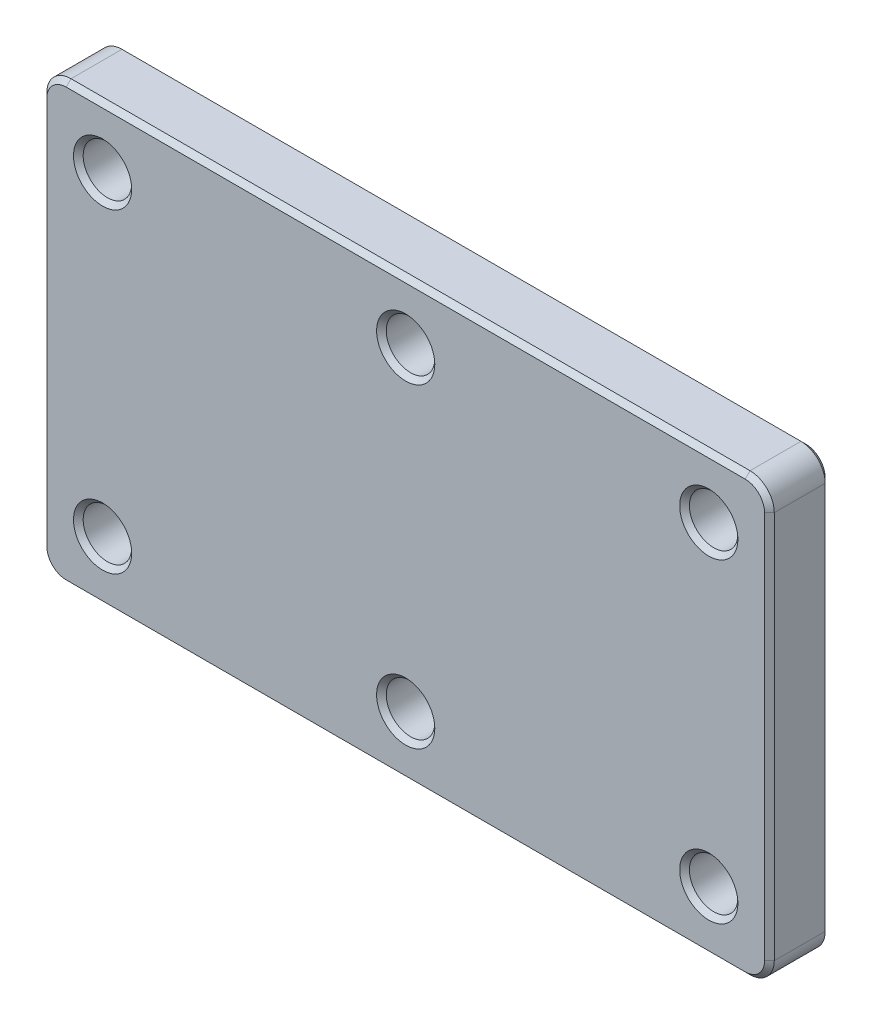
ISO-10303-21;
HEADER;
FILE_DESCRIPTION(('STEP AP214'),'2;1');
FILE_NAME('part.step','',(''),(''),'','','');
FILE_SCHEMA(('AUTOMOTIVE_DESIGN { 1 0 10303 214 1 1 1 1 }'));
ENDSEC;
DATA;
#1=APPLICATION_CONTEXT('core data for automotive mechanical design processes');
#2=APPLICATION_PROTOCOL_DEFINITION('international standard','automotive_design',2000,#1);
#3=PRODUCT_CONTEXT('',#1,'mechanical');
#4=PRODUCT('Part','Part','',(#3));
#5=PRODUCT_RELATED_PRODUCT_CATEGORY('part','',(#4));
#6=PRODUCT_DEFINITION_FORMATION('','',#4);
#7=PRODUCT_DEFINITION_CONTEXT('part definition',#1,'design');
#8=PRODUCT_DEFINITION('design','',#6,#7);
#9=PRODUCT_DEFINITION_SHAPE('','',#8);
#10=(LENGTH_UNIT() NAMED_UNIT(*) SI_UNIT(.MILLI.,.METRE.));
#11=(NAMED_UNIT(*) PLANE_ANGLE_UNIT() SI_UNIT($,.RADIAN.));
#12=(NAMED_UNIT(*) SI_UNIT($,.STERADIAN.) SOLID_ANGLE_UNIT());
#13=UNCERTAINTY_MEASURE_WITH_UNIT(LENGTH_MEASURE(1.E-05),#10,'distance_accuracy_value','');
#14=(GEOMETRIC_REPRESENTATION_CONTEXT(3) GLOBAL_UNCERTAINTY_ASSIGNED_CONTEXT((#13)) GLOBAL_UNIT_ASSIGNED_CONTEXT((#10,
#11,#12)) REPRESENTATION_CONTEXT('',''));
#15=CARTESIAN_POINT('',(0.,0.,0.));
#16=DIRECTION('',(0.,0.,1.));
#17=DIRECTION('',(1.,0.,0.));
#18=AXIS2_PLACEMENT_3D('',#15,#16,#17);
#19=CARTESIAN_POINT('',(-140.,-80.,-25.));
#20=DIRECTION('',(0.,0.,1.));
#21=DIRECTION('',(1.,0.,0.));
#22=AXIS2_PLACEMENT_3D('',#19,#20,#21);
#23=CYLINDRICAL_SURFACE('',#22,10.);
#24=DIRECTION('',(0.,0.,1.));
#25=VECTOR('',#24,1.);
#26=CARTESIAN_POINT('',(-150.,-79.9999999999999,-25.));
#27=LINE('',#26,#25);
#28=CARTESIAN_POINT('',(-150.,-79.9999999999999,-22.9999999999999));
#29=VERTEX_POINT('',#28);
#30=CARTESIAN_POINT('',(-150.,-79.9999999999999,-2.));
#31=VERTEX_POINT('',#30);
#32=EDGE_CURVE('E171',#29,#31,#27,.T.);
#33=ORIENTED_EDGE('',*,*,#32,.F.);
#34=CARTESIAN_POINT('',(-140.,-80.,-22.9999999999999));
#35=DIRECTION('',(0.,0.,1.));
#36=DIRECTION('',(1.,0.,0.));
#37=AXIS2_PLACEMENT_3D('',#34,#35,#36);
#38=CIRCLE('',#37,10.);
#39=CARTESIAN_POINT('',(-140.,-90.,-22.9999999999999));
#40=VERTEX_POINT('',#39);
#41=EDGE_CURVE('E256',#29,#40,#38,.T.);
#42=ORIENTED_EDGE('',*,*,#41,.T.);
#43=DIRECTION('',(0.,0.,1.));
#44=VECTOR('',#43,1.);
#45=CARTESIAN_POINT('',(-140.,-90.,-25.));
#46=LINE('',#45,#44);
#47=CARTESIAN_POINT('',(-140.,-90.,-2.));
#48=VERTEX_POINT('',#47);
#49=EDGE_CURVE('E177',#40,#48,#46,.T.);
#50=ORIENTED_EDGE('',*,*,#49,.T.);
#51=CARTESIAN_POINT('',(-140.,-80.,-2.));
#52=DIRECTION('',(0.,0.,1.));
#53=DIRECTION('',(1.,0.,0.));
#54=AXIS2_PLACEMENT_3D('',#51,#52,#53);
#55=CIRCLE('',#54,10.);
#56=EDGE_CURVE('E254',#48,#31,#55,.F.);
#57=ORIENTED_EDGE('',*,*,#56,.T.);
#58=EDGE_LOOP('',(#33,#42,#50,#57));
#59=FACE_BOUND('',#58,.T.);
#60=ADVANCED_FACE('F33',(#59),#23,.T.);
#61=CARTESIAN_POINT('',(-150.,-79.9999999999999,-25.));
#62=DIRECTION('',(-1.,0.,0.));
#63=DIRECTION('',(0.,0.,1.));
#64=AXIS2_PLACEMENT_3D('',#61,#62,#63);
#65=PLANE('',#64);
#66=DIRECTION('',(0.,0.,1.));
#67=VECTOR('',#66,1.);
#68=CARTESIAN_POINT('',(-150.,79.9999999999999,-25.));
#69=LINE('',#68,#67);
#70=CARTESIAN_POINT('',(-150.,79.9999999999999,-22.9999999999999));
#71=VERTEX_POINT('',#70);
#72=CARTESIAN_POINT('',(-150.,79.9999999999999,-2.));
#73=VERTEX_POINT('',#72);
#74=EDGE_CURVE('E174',#71,#73,#69,.T.);
#75=ORIENTED_EDGE('',*,*,#74,.F.);
#76=DIRECTION('',(0.,-1.,0.));
#77=VECTOR('',#76,1.);
#78=CARTESIAN_POINT('',(-150.,-79.9999999999999,-22.9999999999999));
#79=LINE('',#78,#77);
#80=EDGE_CURVE('E260',#71,#29,#79,.T.);
#81=ORIENTED_EDGE('',*,*,#80,.T.);
#82=ORIENTED_EDGE('',*,*,#32,.T.);
#83=DIRECTION('',(0.,1.,0.));
#84=VECTOR('',#83,1.);
#85=CARTESIAN_POINT('',(-150.,-79.9999999999999,-2.));
#86=LINE('',#85,#84);
#87=EDGE_CURVE('E258',#31,#73,#86,.T.);
#88=ORIENTED_EDGE('',*,*,#87,.T.);
#89=EDGE_LOOP('',(#75,#81,#82,#88));
#90=FACE_BOUND('',#89,.T.);
#91=ADVANCED_FACE('F362',(#90),#65,.T.);
#92=CARTESIAN_POINT('',(-140.,80.,-25.));
#93=DIRECTION('',(0.,0.,1.));
#94=DIRECTION('',(1.,0.,0.));
#95=AXIS2_PLACEMENT_3D('',#92,#93,#94);
#96=CYLINDRICAL_SURFACE('',#95,10.);
#97=DIRECTION('',(0.,0.,1.));
#98=VECTOR('',#97,1.);
#99=CARTESIAN_POINT('',(-140.,90.,-25.));
#100=LINE('',#99,#98);
#101=CARTESIAN_POINT('',(-140.,90.,-22.9999999999999));
#102=VERTEX_POINT('',#101);
#103=CARTESIAN_POINT('',(-140.,90.,-2.));
#104=VERTEX_POINT('',#103);
#105=EDGE_CURVE('E390',#102,#104,#100,.T.);
#106=ORIENTED_EDGE('',*,*,#105,.F.);
#107=CARTESIAN_POINT('',(-140.,80.,-22.9999999999999));
#108=DIRECTION('',(0.,0.,1.));
#109=DIRECTION('',(1.,0.,0.));
#110=AXIS2_PLACEMENT_3D('',#107,#108,#109);
#111=CIRCLE('',#110,10.);
#112=EDGE_CURVE('E264',#102,#71,#111,.T.);
#113=ORIENTED_EDGE('',*,*,#112,.T.);
#114=ORIENTED_EDGE('',*,*,#74,.T.);
#115=CARTESIAN_POINT('',(-140.,80.,-2.));
#116=DIRECTION('',(0.,0.,1.));
#117=DIRECTION('',(1.,0.,0.));
#118=AXIS2_PLACEMENT_3D('',#115,#116,#117);
#119=CIRCLE('',#118,10.);
#120=EDGE_CURVE('E262',#73,#104,#119,.F.);
#121=ORIENTED_EDGE('',*,*,#120,.T.);
#122=EDGE_LOOP('',(#106,#113,#114,#121));
#123=FACE_BOUND('',#122,.T.);
#124=ADVANCED_FACE('F396',(#123),#96,.T.);
#125=CARTESIAN_POINT('',(-140.,90.,-25.));
#126=DIRECTION('',(0.,1.,0.));
#127=DIRECTION('',(-1.,0.,0.));
#128=AXIS2_PLACEMENT_3D('',#125,#126,#127);
#129=PLANE('',#128);
#130=DIRECTION('',(0.,0.,1.));
#131=VECTOR('',#130,1.);
#132=CARTESIAN_POINT('',(140.,90.0000000000001,-25.));
#133=LINE('',#132,#131);
#134=CARTESIAN_POINT('',(140.,90.0000000000001,-22.9999999999999));
#135=VERTEX_POINT('',#134);
#136=CARTESIAN_POINT('',(140.,90.0000000000001,-2.));
#137=VERTEX_POINT('',#136);
#138=EDGE_CURVE('E387',#135,#137,#133,.T.);
#139=ORIENTED_EDGE('',*,*,#138,.F.);
#140=DIRECTION('',(-1.,0.,0.));
#141=VECTOR('',#140,1.);
#142=CARTESIAN_POINT('',(-140.,90.,-22.9999999999999));
#143=LINE('',#142,#141);
#144=EDGE_CURVE('E268',#135,#102,#143,.T.);
#145=ORIENTED_EDGE('',*,*,#144,.T.);
#146=ORIENTED_EDGE('',*,*,#105,.T.);
#147=DIRECTION('',(1.,0.,0.));
#148=VECTOR('',#147,1.);
#149=CARTESIAN_POINT('',(-140.,90.,-2.));
#150=LINE('',#149,#148);
#151=EDGE_CURVE('E266',#104,#137,#150,.T.);
#152=ORIENTED_EDGE('',*,*,#151,.T.);
#153=EDGE_LOOP('',(#139,#145,#146,#152));
#154=FACE_BOUND('',#153,.T.);
#155=ADVANCED_FACE('F411',(#154),#129,.T.);
#156=CARTESIAN_POINT('',(140.,80.,-25.));
#157=DIRECTION('',(0.,0.,1.));
#158=DIRECTION('',(1.,0.,0.));
#159=AXIS2_PLACEMENT_3D('',#156,#157,#158);
#160=CYLINDRICAL_SURFACE('',#159,10.);
#161=DIRECTION('',(0.,0.,1.));
#162=VECTOR('',#161,1.);
#163=CARTESIAN_POINT('',(150.,80.,-25.));
#164=LINE('',#163,#162);
#165=CARTESIAN_POINT('',(150.,80.,-22.9999999999999));
#166=VERTEX_POINT('',#165);
#167=CARTESIAN_POINT('',(150.,80.,-2.));
#168=VERTEX_POINT('',#167);
#169=EDGE_CURVE('E382',#166,#168,#164,.T.);
#170=ORIENTED_EDGE('',*,*,#169,.F.);
#171=CARTESIAN_POINT('',(140.,80.,-22.9999999999999));
#172=DIRECTION('',(0.,0.,1.));
#173=DIRECTION('',(1.,0.,0.));
#174=AXIS2_PLACEMENT_3D('',#171,#172,#173);
#175=CIRCLE('',#174,10.);
#176=EDGE_CURVE('E162',#166,#135,#175,.T.);
#177=ORIENTED_EDGE('',*,*,#176,.T.);
#178=ORIENTED_EDGE('',*,*,#138,.T.);
#179=CARTESIAN_POINT('',(140.,80.,-2.));
#180=DIRECTION('',(0.,0.,1.));
#181=DIRECTION('',(1.,0.,0.));
#182=AXIS2_PLACEMENT_3D('',#179,#180,#181);
#183=CIRCLE('',#182,10.);
#184=EDGE_CURVE('E270',#137,#168,#183,.F.);
#185=ORIENTED_EDGE('',*,*,#184,.T.);
#186=EDGE_LOOP('',(#170,#177,#178,#185));
#187=FACE_BOUND('',#186,.T.);
#188=ADVANCED_FACE('F416',(#187),#160,.T.);
#189=CARTESIAN_POINT('',(150.,80.,-25.));
#190=DIRECTION('',(1.,0.,0.));
#191=DIRECTION('',(0.,1.,0.));
#192=AXIS2_PLACEMENT_3D('',#189,#190,#191);
#193=PLANE('',#192);
#194=DIRECTION('',(0.,0.,1.));
#195=VECTOR('',#194,1.);
#196=CARTESIAN_POINT('',(150.,-79.9999999999999,-25.));
#197=LINE('',#196,#195);
#198=CARTESIAN_POINT('',(150.,-79.9999999999999,-22.9999999999999));
#199=VERTEX_POINT('',#198);
#200=CARTESIAN_POINT('',(150.,-79.9999999999999,-2.));
#201=VERTEX_POINT('',#200);
#202=EDGE_CURVE('E380',#199,#201,#197,.T.);
#203=ORIENTED_EDGE('',*,*,#202,.F.);
#204=DIRECTION('',(0.,1.,0.));
#205=VECTOR('',#204,1.);
#206=CARTESIAN_POINT('',(150.,80.,-22.9999999999999));
#207=LINE('',#206,#205);
#208=EDGE_CURVE('E276',#199,#166,#207,.T.);
#209=ORIENTED_EDGE('',*,*,#208,.T.);
#210=ORIENTED_EDGE('',*,*,#169,.T.);
#211=DIRECTION('',(0.,-1.,0.));
#212=VECTOR('',#211,1.);
#213=CARTESIAN_POINT('',(150.,80.,-2.));
#214=LINE('',#213,#212);
#215=EDGE_CURVE('E274',#168,#201,#214,.T.);
#216=ORIENTED_EDGE('',*,*,#215,.T.);
#217=EDGE_LOOP('',(#203,#209,#210,#216));
#218=FACE_BOUND('',#217,.T.);
#219=ADVANCED_FACE('F425',(#218),#193,.T.);
#220=CARTESIAN_POINT('',(140.,-80.,-25.));
#221=DIRECTION('',(0.,0.,1.));
#222=DIRECTION('',(1.,0.,0.));
#223=AXIS2_PLACEMENT_3D('',#220,#221,#222);
#224=CYLINDRICAL_SURFACE('',#223,10.);
#225=DIRECTION('',(0.,0.,1.));
#226=VECTOR('',#225,1.);
#227=CARTESIAN_POINT('',(140.,-90.,-25.));
#228=LINE('',#227,#226);
#229=CARTESIAN_POINT('',(140.,-90.,-22.9999999999999));
#230=VERTEX_POINT('',#229);
#231=CARTESIAN_POINT('',(140.,-90.,-2.));
#232=VERTEX_POINT('',#231);
#233=EDGE_CURVE('E379',#230,#232,#228,.T.);
#234=ORIENTED_EDGE('',*,*,#233,.F.);
#235=CARTESIAN_POINT('',(140.,-80.,-22.9999999999999));
#236=DIRECTION('',(0.,0.,1.));
#237=DIRECTION('',(1.,0.,0.));
#238=AXIS2_PLACEMENT_3D('',#235,#236,#237);
#239=CIRCLE('',#238,10.);
#240=EDGE_CURVE('E247',#230,#199,#239,.T.);
#241=ORIENTED_EDGE('',*,*,#240,.T.);
#242=ORIENTED_EDGE('',*,*,#202,.T.);
#243=CARTESIAN_POINT('',(140.,-80.,-2.));
#244=DIRECTION('',(0.,0.,1.));
#245=DIRECTION('',(1.,0.,0.));
#246=AXIS2_PLACEMENT_3D('',#243,#244,#245);
#247=CIRCLE('',#246,10.);
#248=EDGE_CURVE('E245',#201,#232,#247,.F.);
#249=ORIENTED_EDGE('',*,*,#248,.T.);
#250=EDGE_LOOP('',(#234,#241,#242,#249));
#251=FACE_BOUND('',#250,.T.);
#252=ADVANCED_FACE('F428',(#251),#224,.T.);
#253=CARTESIAN_POINT('',(140.,-90.,-25.));
#254=DIRECTION('',(0.,-1.,0.));
#255=DIRECTION('',(1.,0.,0.));
#256=AXIS2_PLACEMENT_3D('',#253,#254,#255);
#257=PLANE('',#256);
#258=ORIENTED_EDGE('',*,*,#49,.F.);
#259=DIRECTION('',(1.,0.,0.));
#260=VECTOR('',#259,1.);
#261=CARTESIAN_POINT('',(140.,-90.,-22.9999999999999));
#262=LINE('',#261,#260);
#263=EDGE_CURVE('E252',#40,#230,#262,.T.);
#264=ORIENTED_EDGE('',*,*,#263,.T.);
#265=ORIENTED_EDGE('',*,*,#233,.T.);
#266=DIRECTION('',(-1.,0.,0.));
#267=VECTOR('',#266,1.);
#268=CARTESIAN_POINT('',(140.,-90.,-2.));
#269=LINE('',#268,#267);
#270=EDGE_CURVE('E250',#232,#48,#269,.T.);
#271=ORIENTED_EDGE('',*,*,#270,.T.);
#272=EDGE_LOOP('',(#258,#264,#265,#271));
#273=FACE_BOUND('',#272,.T.);
#274=ADVANCED_FACE('F376',(#273),#257,.T.);
#275=CARTESIAN_POINT('',(-140.,-80.,-25.));
#276=DIRECTION('',(0.,0.,1.));
#277=DIRECTION('',(1.,0.,0.));
#278=AXIS2_PLACEMENT_3D('',#275,#276,#277);
#279=PLANE('',#278);
#280=CARTESIAN_POINT('',(-125.,65.,-25.));
#281=DIRECTION('',(0.,0.,1.));
#282=DIRECTION('',(1.,0.,0.));
#283=AXIS2_PLACEMENT_3D('',#280,#281,#282);
#284=CIRCLE('',#283,12.);
#285=CARTESIAN_POINT('',(-113.,65.,-25.));
#286=VERTEX_POINT('',#285);
#287=EDGE_CURVE('E206',#286,#286,#284,.T.);
#288=ORIENTED_EDGE('',*,*,#287,.T.);
#289=EDGE_LOOP('',(#288));
#290=FACE_BOUND('',#289,.T.);
#291=CARTESIAN_POINT('',(0.,65.,-25.));
#292=DIRECTION('',(0.,0.,1.));
#293=DIRECTION('',(1.,0.,0.));
#294=AXIS2_PLACEMENT_3D('',#291,#292,#293);
#295=CIRCLE('',#294,12.0000000000001);
#296=CARTESIAN_POINT('',(12.0000000000001,65.,-25.));
#297=VERTEX_POINT('',#296);
#298=EDGE_CURVE('E203',#297,#297,#295,.T.);
#299=ORIENTED_EDGE('',*,*,#298,.T.);
#300=EDGE_LOOP('',(#299));
#301=FACE_BOUND('',#300,.T.);
#302=CARTESIAN_POINT('',(125.,65.,-25.));
#303=DIRECTION('',(0.,0.,1.));
#304=DIRECTION('',(1.,0.,0.));
#305=AXIS2_PLACEMENT_3D('',#302,#303,#304);
#306=CIRCLE('',#305,12.);
#307=CARTESIAN_POINT('',(137.,65.,-25.));
#308=VERTEX_POINT('',#307);
#309=EDGE_CURVE('E200',#308,#308,#306,.T.);
#310=ORIENTED_EDGE('',*,*,#309,.T.);
#311=EDGE_LOOP('',(#310));
#312=FACE_BOUND('',#311,.T.);
#313=CARTESIAN_POINT('',(125.,-65.,-25.));
#314=DIRECTION('',(0.,0.,1.));
#315=DIRECTION('',(1.,0.,0.));
#316=AXIS2_PLACEMENT_3D('',#313,#314,#315);
#317=CIRCLE('',#316,12.);
#318=CARTESIAN_POINT('',(137.,-65.,-25.));
#319=VERTEX_POINT('',#318);
#320=EDGE_CURVE('E197',#319,#319,#317,.T.);
#321=ORIENTED_EDGE('',*,*,#320,.T.);
#322=EDGE_LOOP('',(#321));
#323=FACE_BOUND('',#322,.T.);
#324=CARTESIAN_POINT('',(0.,-65.,-25.));
#325=DIRECTION('',(0.,0.,1.));
#326=DIRECTION('',(1.,0.,0.));
#327=AXIS2_PLACEMENT_3D('',#324,#325,#326);
#328=CIRCLE('',#327,12.0000000000001);
#329=CARTESIAN_POINT('',(12.0000000000001,-65.,-25.));
#330=VERTEX_POINT('',#329);
#331=EDGE_CURVE('E194',#330,#330,#328,.T.);
#332=ORIENTED_EDGE('',*,*,#331,.T.);
#333=EDGE_LOOP('',(#332));
#334=FACE_BOUND('',#333,.T.);
#335=CARTESIAN_POINT('',(-125.,-65.,-25.));
#336=DIRECTION('',(0.,0.,1.));
#337=DIRECTION('',(1.,0.,0.));
#338=AXIS2_PLACEMENT_3D('',#335,#336,#337);
#339=CIRCLE('',#338,12.);
#340=CARTESIAN_POINT('',(-113.,-65.,-25.));
#341=VERTEX_POINT('',#340);
#342=EDGE_CURVE('E191',#341,#341,#339,.T.);
#343=ORIENTED_EDGE('',*,*,#342,.T.);
#344=EDGE_LOOP('',(#343));
#345=FACE_BOUND('',#344,.T.);
#346=DIRECTION('',(0.,-1.,0.));
#347=VECTOR('',#346,1.);
#348=CARTESIAN_POINT('',(148.,-79.9999999999999,-25.));
#349=LINE('',#348,#347);
#350=CARTESIAN_POINT('',(148.,80.,-25.));
#351=VERTEX_POINT('',#350);
#352=CARTESIAN_POINT('',(148.,-79.9999999999999,-25.));
#353=VERTEX_POINT('',#352);
#354=EDGE_CURVE('E150',#351,#353,#349,.T.);
#355=ORIENTED_EDGE('',*,*,#354,.T.);
#356=CARTESIAN_POINT('',(140.,-80.,-25.));
#357=DIRECTION('',(0.,0.,1.));
#358=DIRECTION('',(1.,0.,0.));
#359=AXIS2_PLACEMENT_3D('',#356,#357,#358);
#360=CIRCLE('',#359,7.99999999999995);
#361=CARTESIAN_POINT('',(140.,-87.9999999999999,-25.));
#362=VERTEX_POINT('',#361);
#363=EDGE_CURVE('E189',#353,#362,#360,.F.);
#364=ORIENTED_EDGE('',*,*,#363,.T.);
#365=DIRECTION('',(-1.,0.,0.));
#366=VECTOR('',#365,1.);
#367=CARTESIAN_POINT('',(-140.,-88.,-25.));
#368=LINE('',#367,#366);
#369=CARTESIAN_POINT('',(-140.,-88.,-25.));
#370=VERTEX_POINT('',#369);
#371=EDGE_CURVE('E187',#362,#370,#368,.T.);
#372=ORIENTED_EDGE('',*,*,#371,.T.);
#373=CARTESIAN_POINT('',(-140.,-80.,-25.));
#374=DIRECTION('',(0.,0.,1.));
#375=DIRECTION('',(1.,0.,0.));
#376=AXIS2_PLACEMENT_3D('',#373,#374,#375);
#377=CIRCLE('',#376,7.99999999999995);
#378=CARTESIAN_POINT('',(-148.,-80.,-25.));
#379=VERTEX_POINT('',#378);
#380=EDGE_CURVE('E185',#370,#379,#377,.F.);
#381=ORIENTED_EDGE('',*,*,#380,.T.);
#382=DIRECTION('',(0.,1.,0.));
#383=VECTOR('',#382,1.);
#384=CARTESIAN_POINT('',(-148.,79.9999999999999,-25.));
#385=LINE('',#384,#383);
#386=CARTESIAN_POINT('',(-148.,79.9999999999999,-25.));
#387=VERTEX_POINT('',#386);
#388=EDGE_CURVE('E183',#379,#387,#385,.T.);
#389=ORIENTED_EDGE('',*,*,#388,.T.);
#390=CARTESIAN_POINT('',(-140.,80.,-25.));
#391=DIRECTION('',(0.,0.,1.));
#392=DIRECTION('',(1.,0.,0.));
#393=AXIS2_PLACEMENT_3D('',#390,#391,#392);
#394=CIRCLE('',#393,7.99999999999995);
#395=CARTESIAN_POINT('',(-140.,88.,-25.));
#396=VERTEX_POINT('',#395);
#397=EDGE_CURVE('E181',#387,#396,#394,.F.);
#398=ORIENTED_EDGE('',*,*,#397,.T.);
#399=DIRECTION('',(1.,0.,0.));
#400=VECTOR('',#399,1.);
#401=CARTESIAN_POINT('',(140.,88.,-25.));
#402=LINE('',#401,#400);
#403=CARTESIAN_POINT('',(140.,88.,-25.));
#404=VERTEX_POINT('',#403);
#405=EDGE_CURVE('E153',#396,#404,#402,.T.);
#406=ORIENTED_EDGE('',*,*,#405,.T.);
#407=CARTESIAN_POINT('',(140.,80.,-25.));
#408=DIRECTION('',(0.,0.,1.));
#409=DIRECTION('',(1.,0.,0.));
#410=AXIS2_PLACEMENT_3D('',#407,#408,#409);
#411=CIRCLE('',#410,7.99999999999995);
#412=EDGE_CURVE('E145',#404,#351,#411,.F.);
#413=ORIENTED_EDGE('',*,*,#412,.T.);
#414=EDGE_LOOP('',(#355,#364,#372,#381,#389,#398,#406,#413));
#415=FACE_BOUND('',#414,.T.);
#416=ADVANCED_FACE('F147',(#290,#301,#312,#323,#334,#345,#415),#279,.F.);
#417=CARTESIAN_POINT('',(-140.,-80.,0.));
#418=DIRECTION('',(0.,0.,1.));
#419=DIRECTION('',(1.,0.,0.));
#420=AXIS2_PLACEMENT_3D('',#417,#418,#419);
#421=PLANE('',#420);
#422=DIRECTION('',(0.,1.,0.));
#423=VECTOR('',#422,1.);
#424=CARTESIAN_POINT('',(148.,-79.9999999999999,0.));
#425=LINE('',#424,#423);
#426=CARTESIAN_POINT('',(148.,-79.9999999999999,0.));
#427=VERTEX_POINT('',#426);
#428=CARTESIAN_POINT('',(148.,80.,0.));
#429=VERTEX_POINT('',#428);
#430=EDGE_CURVE('E42',#427,#429,#425,.T.);
#431=ORIENTED_EDGE('',*,*,#430,.T.);
#432=CARTESIAN_POINT('',(140.,80.,0.));
#433=DIRECTION('',(0.,0.,1.));
#434=DIRECTION('',(1.,0.,0.));
#435=AXIS2_PLACEMENT_3D('',#432,#433,#434);
#436=CIRCLE('',#435,8.00000000000004);
#437=CARTESIAN_POINT('',(140.,88.0000000000001,0.));
#438=VERTEX_POINT('',#437);
#439=EDGE_CURVE('E11',#429,#438,#436,.T.);
#440=ORIENTED_EDGE('',*,*,#439,.T.);
#441=DIRECTION('',(-1.,0.,0.));
#442=VECTOR('',#441,1.);
#443=CARTESIAN_POINT('',(-140.,88.,0.));
#444=LINE('',#443,#442);
#445=CARTESIAN_POINT('',(-140.,88.0000000000001,0.));
#446=VERTEX_POINT('',#445);
#447=EDGE_CURVE('E304',#438,#446,#444,.T.);
#448=ORIENTED_EDGE('',*,*,#447,.T.);
#449=CARTESIAN_POINT('',(-140.,80.,0.));
#450=DIRECTION('',(0.,0.,1.));
#451=DIRECTION('',(1.,0.,0.));
#452=AXIS2_PLACEMENT_3D('',#449,#450,#451);
#453=CIRCLE('',#452,8.00000000000004);
#454=CARTESIAN_POINT('',(-148.,80.,0.));
#455=VERTEX_POINT('',#454);
#456=EDGE_CURVE('E302',#446,#455,#453,.T.);
#457=ORIENTED_EDGE('',*,*,#456,.T.);
#458=DIRECTION('',(0.,-1.,0.));
#459=VECTOR('',#458,1.);
#460=CARTESIAN_POINT('',(-148.,-80.,0.));
#461=LINE('',#460,#459);
#462=CARTESIAN_POINT('',(-148.,-79.9999999999999,0.));
#463=VERTEX_POINT('',#462);
#464=EDGE_CURVE('E300',#455,#463,#461,.T.);
#465=ORIENTED_EDGE('',*,*,#464,.T.);
#466=CARTESIAN_POINT('',(-140.,-80.,0.));
#467=DIRECTION('',(0.,0.,1.));
#468=DIRECTION('',(1.,0.,0.));
#469=AXIS2_PLACEMENT_3D('',#466,#467,#468);
#470=CIRCLE('',#469,8.00000000000004);
#471=CARTESIAN_POINT('',(-140.,-88.,0.));
#472=VERTEX_POINT('',#471);
#473=EDGE_CURVE('E298',#463,#472,#470,.T.);
#474=ORIENTED_EDGE('',*,*,#473,.T.);
#475=DIRECTION('',(1.,0.,0.));
#476=VECTOR('',#475,1.);
#477=CARTESIAN_POINT('',(-140.,-88.,0.));
#478=LINE('',#477,#476);
#479=CARTESIAN_POINT('',(140.,-88.,0.));
#480=VERTEX_POINT('',#479);
#481=EDGE_CURVE('E296',#472,#480,#478,.T.);
#482=ORIENTED_EDGE('',*,*,#481,.T.);
#483=CARTESIAN_POINT('',(140.,-80.,0.));
#484=DIRECTION('',(0.,0.,1.));
#485=DIRECTION('',(1.,0.,0.));
#486=AXIS2_PLACEMENT_3D('',#483,#484,#485);
#487=CIRCLE('',#486,8.00000000000004);
#488=EDGE_CURVE('E53',#480,#427,#487,.T.);
#489=ORIENTED_EDGE('',*,*,#488,.T.);
#490=EDGE_LOOP('',(#431,#440,#448,#457,#465,#474,#482,#489));
#491=FACE_BOUND('',#490,.T.);
#492=CARTESIAN_POINT('',(-125.,-65.,0.));
#493=DIRECTION('',(0.,0.,1.));
#494=DIRECTION('',(1.,0.,0.));
#495=AXIS2_PLACEMENT_3D('',#492,#493,#494);
#496=CIRCLE('',#495,12.);
#497=CARTESIAN_POINT('',(-113.,-65.,0.));
#498=VERTEX_POINT('',#497);
#499=EDGE_CURVE('E293',#498,#498,#496,.F.);
#500=ORIENTED_EDGE('',*,*,#499,.T.);
#501=EDGE_LOOP('',(#500));
#502=FACE_BOUND('',#501,.T.);
#503=CARTESIAN_POINT('',(0.,-65.,0.));
#504=DIRECTION('',(0.,0.,1.));
#505=DIRECTION('',(1.,0.,0.));
#506=AXIS2_PLACEMENT_3D('',#503,#504,#505);
#507=CIRCLE('',#506,12.);
#508=CARTESIAN_POINT('',(12.,-65.,0.));
#509=VERTEX_POINT('',#508);
#510=EDGE_CURVE('E290',#509,#509,#507,.F.);
#511=ORIENTED_EDGE('',*,*,#510,.T.);
#512=EDGE_LOOP('',(#511));
#513=FACE_BOUND('',#512,.T.);
#514=CARTESIAN_POINT('',(125.,-65.,0.));
#515=DIRECTION('',(0.,0.,1.));
#516=DIRECTION('',(1.,0.,0.));
#517=AXIS2_PLACEMENT_3D('',#514,#515,#516);
#518=CIRCLE('',#517,12.);
#519=CARTESIAN_POINT('',(137.,-65.,0.));
#520=VERTEX_POINT('',#519);
#521=EDGE_CURVE('E287',#520,#520,#518,.F.);
#522=ORIENTED_EDGE('',*,*,#521,.T.);
#523=EDGE_LOOP('',(#522));
#524=FACE_BOUND('',#523,.T.);
#525=CARTESIAN_POINT('',(125.,65.,0.));
#526=DIRECTION('',(0.,0.,1.));
#527=DIRECTION('',(1.,0.,0.));
#528=AXIS2_PLACEMENT_3D('',#525,#526,#527);
#529=CIRCLE('',#528,12.);
#530=CARTESIAN_POINT('',(137.,65.,0.));
#531=VERTEX_POINT('',#530);
#532=EDGE_CURVE('E284',#531,#531,#529,.F.);
#533=ORIENTED_EDGE('',*,*,#532,.T.);
#534=EDGE_LOOP('',(#533));
#535=FACE_BOUND('',#534,.T.);
#536=CARTESIAN_POINT('',(0.,65.,0.));
#537=DIRECTION('',(0.,0.,1.));
#538=DIRECTION('',(1.,0.,0.));
#539=AXIS2_PLACEMENT_3D('',#536,#537,#538);
#540=CIRCLE('',#539,12.);
#541=CARTESIAN_POINT('',(12.,65.,0.));
#542=VERTEX_POINT('',#541);
#543=EDGE_CURVE('E281',#542,#542,#540,.F.);
#544=ORIENTED_EDGE('',*,*,#543,.T.);
#545=EDGE_LOOP('',(#544));
#546=FACE_BOUND('',#545,.T.);
#547=CARTESIAN_POINT('',(-125.,65.,0.));
#548=DIRECTION('',(0.,0.,1.));
#549=DIRECTION('',(1.,0.,0.));
#550=AXIS2_PLACEMENT_3D('',#547,#548,#549);
#551=CIRCLE('',#550,12.);
#552=CARTESIAN_POINT('',(-113.,65.,0.));
#553=VERTEX_POINT('',#552);
#554=EDGE_CURVE('E278',#553,#553,#551,.F.);
#555=ORIENTED_EDGE('',*,*,#554,.T.);
#556=EDGE_LOOP('',(#555));
#557=FACE_BOUND('',#556,.T.);
#558=ADVANCED_FACE('F728',(#491,#502,#513,#524,#535,#546,#557),#421,.T.);
#559=CARTESIAN_POINT('',(0.,-65.,-25.));
#560=DIRECTION('',(0.,0.,1.));
#561=DIRECTION('',(1.,0.,0.));
#562=AXIS2_PLACEMENT_3D('',#559,#560,#561);
#563=CYLINDRICAL_SURFACE('',#562,10.);
#564=CARTESIAN_POINT('',(0.,-65.,-22.9999999999999));
#565=DIRECTION('',(0.,0.,1.));
#566=DIRECTION('',(1.,0.,0.));
#567=AXIS2_PLACEMENT_3D('',#564,#565,#566);
#568=CIRCLE('',#567,10.);
#569=CARTESIAN_POINT('',(10.,-65.,-22.9999999999999));
#570=VERTEX_POINT('',#569);
#571=EDGE_CURVE('E236',#570,#570,#568,.F.);
#572=ORIENTED_EDGE('',*,*,#571,.T.);
#573=EDGE_LOOP('',(#572));
#574=FACE_BOUND('',#573,.T.);
#575=CARTESIAN_POINT('',(0.,-65.,-1.99999999999999));
#576=DIRECTION('',(0.,0.,1.));
#577=DIRECTION('',(1.,0.,0.));
#578=AXIS2_PLACEMENT_3D('',#575,#576,#577);
#579=CIRCLE('',#578,10.);
#580=CARTESIAN_POINT('',(10.,-65.,-1.99999999999999));
#581=VERTEX_POINT('',#580);
#582=EDGE_CURVE('E233',#581,#581,#579,.T.);
#583=ORIENTED_EDGE('',*,*,#582,.T.);
#584=EDGE_LOOP('',(#583));
#585=FACE_BOUND('',#584,.T.);
#586=ADVANCED_FACE('F719',(#574,#585),#563,.F.);
#587=CARTESIAN_POINT('',(-125.,-65.,-25.));
#588=DIRECTION('',(0.,0.,1.));
#589=DIRECTION('',(1.,0.,0.));
#590=AXIS2_PLACEMENT_3D('',#587,#588,#589);
#591=CYLINDRICAL_SURFACE('',#590,9.99999999999999);
#592=CARTESIAN_POINT('',(-125.,-65.,-23.));
#593=DIRECTION('',(0.,0.,1.));
#594=DIRECTION('',(1.,0.,0.));
#595=AXIS2_PLACEMENT_3D('',#592,#593,#594);
#596=CIRCLE('',#595,9.99999999999999);
#597=CARTESIAN_POINT('',(-115.,-65.,-23.));
#598=VERTEX_POINT('',#597);
#599=EDGE_CURVE('E242',#598,#598,#596,.F.);
#600=ORIENTED_EDGE('',*,*,#599,.T.);
#601=EDGE_LOOP('',(#600));
#602=FACE_BOUND('',#601,.T.);
#603=CARTESIAN_POINT('',(-125.,-65.,-1.99999999999999));
#604=DIRECTION('',(0.,0.,1.));
#605=DIRECTION('',(1.,0.,0.));
#606=AXIS2_PLACEMENT_3D('',#603,#604,#605);
#607=CIRCLE('',#606,9.99999999999999);
#608=CARTESIAN_POINT('',(-115.,-65.,-1.99999999999999));
#609=VERTEX_POINT('',#608);
#610=EDGE_CURVE('E239',#609,#609,#607,.T.);
#611=ORIENTED_EDGE('',*,*,#610,.T.);
#612=EDGE_LOOP('',(#611));
#613=FACE_BOUND('',#612,.T.);
#614=ADVANCED_FACE('F710',(#602,#613),#591,.F.);
#615=CARTESIAN_POINT('',(125.,-65.,-25.));
#616=DIRECTION('',(0.,0.,1.));
#617=DIRECTION('',(1.,0.,0.));
#618=AXIS2_PLACEMENT_3D('',#615,#616,#617);
#619=CYLINDRICAL_SURFACE('',#618,9.99999999999999);
#620=CARTESIAN_POINT('',(125.,-65.,-23.));
#621=DIRECTION('',(0.,0.,1.));
#622=DIRECTION('',(1.,0.,0.));
#623=AXIS2_PLACEMENT_3D('',#620,#621,#622);
#624=CIRCLE('',#623,9.99999999999999);
#625=CARTESIAN_POINT('',(135.,-65.,-23.));
#626=VERTEX_POINT('',#625);
#627=EDGE_CURVE('E230',#626,#626,#624,.F.);
#628=ORIENTED_EDGE('',*,*,#627,.T.);
#629=EDGE_LOOP('',(#628));
#630=FACE_BOUND('',#629,.T.);
#631=CARTESIAN_POINT('',(125.,-65.,-1.99999999999999));
#632=DIRECTION('',(0.,0.,1.));
#633=DIRECTION('',(1.,0.,0.));
#634=AXIS2_PLACEMENT_3D('',#631,#632,#633);
#635=CIRCLE('',#634,9.99999999999999);
#636=CARTESIAN_POINT('',(135.,-65.,-1.99999999999999));
#637=VERTEX_POINT('',#636);
#638=EDGE_CURVE('E227',#637,#637,#635,.T.);
#639=ORIENTED_EDGE('',*,*,#638,.T.);
#640=EDGE_LOOP('',(#639));
#641=FACE_BOUND('',#640,.T.);
#642=ADVANCED_FACE('F701',(#630,#641),#619,.F.);
#643=CARTESIAN_POINT('',(125.,65.,-25.));
#644=DIRECTION('',(0.,0.,1.));
#645=DIRECTION('',(1.,0.,0.));
#646=AXIS2_PLACEMENT_3D('',#643,#644,#645);
#647=CYLINDRICAL_SURFACE('',#646,9.99999999999999);
#648=CARTESIAN_POINT('',(125.,65.,-23.));
#649=DIRECTION('',(0.,0.,1.));
#650=DIRECTION('',(1.,0.,0.));
#651=AXIS2_PLACEMENT_3D('',#648,#649,#650);
#652=CIRCLE('',#651,9.99999999999999);
#653=CARTESIAN_POINT('',(135.,65.,-23.));
#654=VERTEX_POINT('',#653);
#655=EDGE_CURVE('E224',#654,#654,#652,.F.);
#656=ORIENTED_EDGE('',*,*,#655,.T.);
#657=EDGE_LOOP('',(#656));
#658=FACE_BOUND('',#657,.T.);
#659=CARTESIAN_POINT('',(125.,65.,-1.99999999999999));
#660=DIRECTION('',(0.,0.,1.));
#661=DIRECTION('',(1.,0.,0.));
#662=AXIS2_PLACEMENT_3D('',#659,#660,#661);
#663=CIRCLE('',#662,9.99999999999999);
#664=CARTESIAN_POINT('',(135.,65.,-1.99999999999999));
#665=VERTEX_POINT('',#664);
#666=EDGE_CURVE('E221',#665,#665,#663,.T.);
#667=ORIENTED_EDGE('',*,*,#666,.T.);
#668=EDGE_LOOP('',(#667));
#669=FACE_BOUND('',#668,.T.);
#670=ADVANCED_FACE('F692',(#658,#669),#647,.F.);
#671=CARTESIAN_POINT('',(0.,65.,-25.));
#672=DIRECTION('',(0.,0.,1.));
#673=DIRECTION('',(1.,0.,0.));
#674=AXIS2_PLACEMENT_3D('',#671,#672,#673);
#675=CYLINDRICAL_SURFACE('',#674,10.);
#676=CARTESIAN_POINT('',(0.,65.,-22.9999999999999));
#677=DIRECTION('',(0.,0.,1.));
#678=DIRECTION('',(1.,0.,0.));
#679=AXIS2_PLACEMENT_3D('',#676,#677,#678);
#680=CIRCLE('',#679,10.);
#681=CARTESIAN_POINT('',(10.,65.,-22.9999999999999));
#682=VERTEX_POINT('',#681);
#683=EDGE_CURVE('E218',#682,#682,#680,.F.);
#684=ORIENTED_EDGE('',*,*,#683,.T.);
#685=EDGE_LOOP('',(#684));
#686=FACE_BOUND('',#685,.T.);
#687=CARTESIAN_POINT('',(0.,65.,-1.99999999999999));
#688=DIRECTION('',(0.,0.,1.));
#689=DIRECTION('',(1.,0.,0.));
#690=AXIS2_PLACEMENT_3D('',#687,#688,#689);
#691=CIRCLE('',#690,10.);
#692=CARTESIAN_POINT('',(10.,65.,-1.99999999999999));
#693=VERTEX_POINT('',#692);
#694=EDGE_CURVE('E215',#693,#693,#691,.T.);
#695=ORIENTED_EDGE('',*,*,#694,.T.);
#696=EDGE_LOOP('',(#695));
#697=FACE_BOUND('',#696,.T.);
#698=ADVANCED_FACE('F683',(#686,#697),#675,.F.);
#699=CARTESIAN_POINT('',(-125.,65.,-25.));
#700=DIRECTION('',(0.,0.,1.));
#701=DIRECTION('',(1.,0.,0.));
#702=AXIS2_PLACEMENT_3D('',#699,#700,#701);
#703=CYLINDRICAL_SURFACE('',#702,9.99999999999999);
#704=CARTESIAN_POINT('',(-125.,65.,-23.));
#705=DIRECTION('',(0.,0.,1.));
#706=DIRECTION('',(1.,0.,0.));
#707=AXIS2_PLACEMENT_3D('',#704,#705,#706);
#708=CIRCLE('',#707,9.99999999999999);
#709=CARTESIAN_POINT('',(-115.,65.,-23.));
#710=VERTEX_POINT('',#709);
#711=EDGE_CURVE('E212',#710,#710,#708,.F.);
#712=ORIENTED_EDGE('',*,*,#711,.T.);
#713=EDGE_LOOP('',(#712));
#714=FACE_BOUND('',#713,.T.);
#715=CARTESIAN_POINT('',(-125.,65.,-1.99999999999999));
#716=DIRECTION('',(0.,0.,1.));
#717=DIRECTION('',(1.,0.,0.));
#718=AXIS2_PLACEMENT_3D('',#715,#716,#717);
#719=CIRCLE('',#718,9.99999999999999);
#720=CARTESIAN_POINT('',(-115.,65.,-1.99999999999999));
#721=VERTEX_POINT('',#720);
#722=EDGE_CURVE('E209',#721,#721,#719,.T.);
#723=ORIENTED_EDGE('',*,*,#722,.T.);
#724=EDGE_LOOP('',(#723));
#725=FACE_BOUND('',#724,.T.);
#726=ADVANCED_FACE('F453',(#714,#725),#703,.F.);
#727=CARTESIAN_POINT('',(-125.,65.,-25.));
#728=DIRECTION('',(0.,0.,-1.));
#729=DIRECTION('',(-1.,0.,0.));
#730=AXIS2_PLACEMENT_3D('',#727,#728,#729);
#731=CONICAL_SURFACE('',#730,12.,0.78539816339744);
#732=ORIENTED_EDGE('',*,*,#711,.F.);
#733=EDGE_LOOP('',(#732));
#734=FACE_BOUND('',#733,.T.);
#735=ORIENTED_EDGE('',*,*,#287,.F.);
#736=EDGE_LOOP('',(#735));
#737=FACE_BOUND('',#736,.T.);
#738=ADVANCED_FACE('F449',(#734,#737),#731,.F.);
#739=CARTESIAN_POINT('',(0.,65.,-25.));
#740=DIRECTION('',(0.,0.,-1.));
#741=DIRECTION('',(-1.,0.,0.));
#742=AXIS2_PLACEMENT_3D('',#739,#740,#741);
#743=CONICAL_SURFACE('',#742,12.0000000000001,0.785398163397457);
#744=ORIENTED_EDGE('',*,*,#683,.F.);
#745=EDGE_LOOP('',(#744));
#746=FACE_BOUND('',#745,.T.);
#747=ORIENTED_EDGE('',*,*,#298,.F.);
#748=EDGE_LOOP('',(#747));
#749=FACE_BOUND('',#748,.T.);
#750=ADVANCED_FACE('F452',(#746,#749),#743,.F.);
#751=CARTESIAN_POINT('',(125.,65.,-25.));
#752=DIRECTION('',(0.,0.,-1.));
#753=DIRECTION('',(-1.,0.,0.));
#754=AXIS2_PLACEMENT_3D('',#751,#752,#753);
#755=CONICAL_SURFACE('',#754,12.,0.785398163397444);
#756=ORIENTED_EDGE('',*,*,#655,.F.);
#757=EDGE_LOOP('',(#756));
#758=FACE_BOUND('',#757,.T.);
#759=ORIENTED_EDGE('',*,*,#309,.F.);
#760=EDGE_LOOP('',(#759));
#761=FACE_BOUND('',#760,.T.);
#762=ADVANCED_FACE('F457',(#758,#761),#755,.F.);
#763=CARTESIAN_POINT('',(125.,-65.,-25.));
#764=DIRECTION('',(0.,0.,-1.));
#765=DIRECTION('',(-1.,0.,0.));
#766=AXIS2_PLACEMENT_3D('',#763,#764,#765);
#767=CONICAL_SURFACE('',#766,12.,0.78539816339744);
#768=ORIENTED_EDGE('',*,*,#627,.F.);
#769=EDGE_LOOP('',(#768));
#770=FACE_BOUND('',#769,.T.);
#771=ORIENTED_EDGE('',*,*,#320,.F.);
#772=EDGE_LOOP('',(#771));
#773=FACE_BOUND('',#772,.T.);
#774=ADVANCED_FACE('F461',(#770,#773),#767,.F.);
#775=CARTESIAN_POINT('',(0.,-65.,-25.));
#776=DIRECTION('',(0.,0.,-1.));
#777=DIRECTION('',(-1.,0.,0.));
#778=AXIS2_PLACEMENT_3D('',#775,#776,#777);
#779=CONICAL_SURFACE('',#778,12.0000000000001,0.785398163397457);
#780=ORIENTED_EDGE('',*,*,#571,.F.);
#781=EDGE_LOOP('',(#780));
#782=FACE_BOUND('',#781,.T.);
#783=ORIENTED_EDGE('',*,*,#331,.F.);
#784=EDGE_LOOP('',(#783));
#785=FACE_BOUND('',#784,.T.);
#786=ADVANCED_FACE('F465',(#782,#785),#779,.F.);
#787=CARTESIAN_POINT('',(-125.,-65.,-25.));
#788=DIRECTION('',(0.,0.,-1.));
#789=DIRECTION('',(-1.,0.,0.));
#790=AXIS2_PLACEMENT_3D('',#787,#788,#789);
#791=CONICAL_SURFACE('',#790,12.,0.785398163397443);
#792=ORIENTED_EDGE('',*,*,#599,.F.);
#793=EDGE_LOOP('',(#792));
#794=FACE_BOUND('',#793,.T.);
#795=ORIENTED_EDGE('',*,*,#342,.F.);
#796=EDGE_LOOP('',(#795));
#797=FACE_BOUND('',#796,.T.);
#798=ADVANCED_FACE('F469',(#794,#797),#791,.F.);
#799=CARTESIAN_POINT('',(-140.,80.,-22.9999999999999));
#800=DIRECTION('',(0.,0.,1.));
#801=DIRECTION('',(1.,0.,0.));
#802=AXIS2_PLACEMENT_3D('',#799,#800,#801);
#803=CONICAL_SURFACE('',#802,10.,0.78539816339744);
#804=DIRECTION('',(0.,0.707106781186543,0.707106781186552));
#805=VECTOR('',#804,1.);
#806=CARTESIAN_POINT('',(-140.,88.,-25.));
#807=LINE('',#806,#805);
#808=EDGE_CURVE('E317',#396,#102,#807,.T.);
#809=ORIENTED_EDGE('',*,*,#808,.F.);
#810=ORIENTED_EDGE('',*,*,#397,.F.);
#811=DIRECTION('',(0.707106781186543,0.,-0.707106781186552));
#812=VECTOR('',#811,1.);
#813=CARTESIAN_POINT('',(-150.,79.9999999999999,-22.9999999999999));
#814=LINE('',#813,#812);
#815=EDGE_CURVE('E320',#71,#387,#814,.T.);
#816=ORIENTED_EDGE('',*,*,#815,.F.);
#817=ORIENTED_EDGE('',*,*,#112,.F.);
#818=EDGE_LOOP('',(#809,#810,#816,#817));
#819=FACE_BOUND('',#818,.T.);
#820=ADVANCED_FACE('F473',(#819),#803,.T.);
#821=CARTESIAN_POINT('',(-150.,-79.9999999999999,-22.9999999999999));
#822=DIRECTION('',(-0.707106781186552,0.,-0.707106781186543));
#823=DIRECTION('',(0.,1.,0.));
#824=AXIS2_PLACEMENT_3D('',#821,#822,#823);
#825=PLANE('',#824);
#826=ORIENTED_EDGE('',*,*,#815,.T.);
#827=ORIENTED_EDGE('',*,*,#388,.F.);
#828=DIRECTION('',(0.707106781186543,0.,-0.707106781186552));
#829=VECTOR('',#828,1.);
#830=CARTESIAN_POINT('',(-150.,-79.9999999999999,-22.9999999999999));
#831=LINE('',#830,#829);
#832=EDGE_CURVE('E314',#29,#379,#831,.T.);
#833=ORIENTED_EDGE('',*,*,#832,.F.);
#834=ORIENTED_EDGE('',*,*,#80,.F.);
#835=EDGE_LOOP('',(#826,#827,#833,#834));
#836=FACE_BOUND('',#835,.T.);
#837=ADVANCED_FACE('F367',(#836),#825,.T.);
#838=CARTESIAN_POINT('',(-140.,90.,-22.9999999999999));
#839=DIRECTION('',(0.,0.707106781186555,-0.70710678118654));
#840=DIRECTION('',(1.,0.,0.));
#841=AXIS2_PLACEMENT_3D('',#838,#839,#840);
#842=PLANE('',#841);
#843=ORIENTED_EDGE('',*,*,#808,.T.);
#844=ORIENTED_EDGE('',*,*,#144,.F.);
#845=DIRECTION('',(0.,0.70710678118654,0.707106781186555));
#846=VECTOR('',#845,1.);
#847=CARTESIAN_POINT('',(140.,88.,-25.));
#848=LINE('',#847,#846);
#849=EDGE_CURVE('E312',#404,#135,#848,.T.);
#850=ORIENTED_EDGE('',*,*,#849,.F.);
#851=ORIENTED_EDGE('',*,*,#405,.F.);
#852=EDGE_LOOP('',(#843,#844,#850,#851));
#853=FACE_BOUND('',#852,.T.);
#854=ADVANCED_FACE('F489',(#853),#842,.T.);
#855=CARTESIAN_POINT('',(-140.,-80.,-22.9999999999999));
#856=DIRECTION('',(0.,0.,1.));
#857=DIRECTION('',(1.,0.,0.));
#858=AXIS2_PLACEMENT_3D('',#855,#856,#857);
#859=CONICAL_SURFACE('',#858,10.,0.785398163397443);
#860=ORIENTED_EDGE('',*,*,#832,.T.);
#861=ORIENTED_EDGE('',*,*,#380,.F.);
#862=DIRECTION('',(0.,0.70710678118654,-0.707106781186555));
#863=VECTOR('',#862,1.);
#864=CARTESIAN_POINT('',(-140.,-90.,-22.9999999999999));
#865=LINE('',#864,#863);
#866=EDGE_CURVE('E165',#40,#370,#865,.T.);
#867=ORIENTED_EDGE('',*,*,#866,.F.);
#868=ORIENTED_EDGE('',*,*,#41,.F.);
#869=EDGE_LOOP('',(#860,#861,#867,#868));
#870=FACE_BOUND('',#869,.T.);
#871=ADVANCED_FACE('F373',(#870),#859,.T.);
#872=CARTESIAN_POINT('',(140.,80.,-22.9999999999999));
#873=DIRECTION('',(0.,0.,1.));
#874=DIRECTION('',(1.,0.,0.));
#875=AXIS2_PLACEMENT_3D('',#872,#873,#874);
#876=CONICAL_SURFACE('',#875,10.,0.785398163397441);
#877=ORIENTED_EDGE('',*,*,#849,.T.);
#878=ORIENTED_EDGE('',*,*,#176,.F.);
#879=DIRECTION('',(0.707106781186543,0.,0.707106781186552));
#880=VECTOR('',#879,1.);
#881=CARTESIAN_POINT('',(148.,80.,-25.));
#882=LINE('',#881,#880);
#883=EDGE_CURVE('E160',#351,#166,#882,.T.);
#884=ORIENTED_EDGE('',*,*,#883,.F.);
#885=ORIENTED_EDGE('',*,*,#412,.F.);
#886=EDGE_LOOP('',(#877,#878,#884,#885));
#887=FACE_BOUND('',#886,.T.);
#888=ADVANCED_FACE('F161',(#887),#876,.T.);
#889=CARTESIAN_POINT('',(140.,-90.,-22.9999999999999));
#890=DIRECTION('',(0.,-0.707106781186552,-0.707106781186543));
#891=DIRECTION('',(-1.,0.,0.));
#892=AXIS2_PLACEMENT_3D('',#889,#890,#891);
#893=PLANE('',#892);
#894=ORIENTED_EDGE('',*,*,#866,.T.);
#895=ORIENTED_EDGE('',*,*,#371,.F.);
#896=DIRECTION('',(0.,0.707106781186543,-0.707106781186552));
#897=VECTOR('',#896,1.);
#898=CARTESIAN_POINT('',(140.,-90.,-22.9999999999999));
#899=LINE('',#898,#897);
#900=EDGE_CURVE('E166',#230,#362,#899,.T.);
#901=ORIENTED_EDGE('',*,*,#900,.F.);
#902=ORIENTED_EDGE('',*,*,#263,.F.);
#903=EDGE_LOOP('',(#894,#895,#901,#902));
#904=FACE_BOUND('',#903,.T.);
#905=ADVANCED_FACE('F481',(#904),#893,.T.);
#906=CARTESIAN_POINT('',(150.,80.,-22.9999999999999));
#907=DIRECTION('',(0.707106781186552,0.,-0.707106781186543));
#908=DIRECTION('',(0.,-1.,0.));
#909=AXIS2_PLACEMENT_3D('',#906,#907,#908);
#910=PLANE('',#909);
#911=ORIENTED_EDGE('',*,*,#883,.T.);
#912=ORIENTED_EDGE('',*,*,#208,.F.);
#913=DIRECTION('',(0.707106781186543,0.,0.707106781186552));
#914=VECTOR('',#913,1.);
#915=CARTESIAN_POINT('',(148.,-79.9999999999999,-25.));
#916=LINE('',#915,#914);
#917=EDGE_CURVE('E170',#353,#199,#916,.T.);
#918=ORIENTED_EDGE('',*,*,#917,.F.);
#919=ORIENTED_EDGE('',*,*,#354,.F.);
#920=EDGE_LOOP('',(#911,#912,#918,#919));
#921=FACE_BOUND('',#920,.T.);
#922=ADVANCED_FACE('F169',(#921),#910,.T.);
#923=CARTESIAN_POINT('',(140.,-80.,-22.9999999999999));
#924=DIRECTION('',(0.,0.,1.));
#925=DIRECTION('',(1.,0.,0.));
#926=AXIS2_PLACEMENT_3D('',#923,#924,#925);
#927=CONICAL_SURFACE('',#926,10.,0.78539816339744);
#928=ORIENTED_EDGE('',*,*,#900,.T.);
#929=ORIENTED_EDGE('',*,*,#363,.F.);
#930=ORIENTED_EDGE('',*,*,#917,.T.);
#931=ORIENTED_EDGE('',*,*,#240,.F.);
#932=EDGE_LOOP('',(#928,#929,#930,#931));
#933=FACE_BOUND('',#932,.T.);
#934=ADVANCED_FACE('F475',(#933),#927,.T.);
#935=CARTESIAN_POINT('',(-140.,-80.,0.));
#936=DIRECTION('',(0.,0.,-1.));
#937=DIRECTION('',(-1.,0.,0.));
#938=AXIS2_PLACEMENT_3D('',#935,#936,#937);
#939=CONICAL_SURFACE('',#938,8.00000000000004,0.78539816339744);
#940=DIRECTION('',(0.707106781186543,0.,0.707106781186552));
#941=VECTOR('',#940,1.);
#942=CARTESIAN_POINT('',(-150.,-79.9999999999999,-2.));
#943=LINE('',#942,#941);
#944=EDGE_CURVE('E338',#31,#463,#943,.T.);
#945=ORIENTED_EDGE('',*,*,#944,.F.);
#946=ORIENTED_EDGE('',*,*,#56,.F.);
#947=DIRECTION('',(0.,-0.707106781186543,-0.707106781186552));
#948=VECTOR('',#947,1.);
#949=CARTESIAN_POINT('',(-140.,-88.0000000000001,0.));
#950=LINE('',#949,#948);
#951=EDGE_CURVE('E37',#472,#48,#950,.T.);
#952=ORIENTED_EDGE('',*,*,#951,.F.);
#953=ORIENTED_EDGE('',*,*,#473,.F.);
#954=EDGE_LOOP('',(#945,#946,#952,#953));
#955=FACE_BOUND('',#954,.T.);
#956=ADVANCED_FACE('F354',(#955),#939,.T.);
#957=CARTESIAN_POINT('',(-140.,-88.,0.));
#958=DIRECTION('',(0.,0.707106781186552,-0.707106781186543));
#959=DIRECTION('',(1.,0.,0.));
#960=AXIS2_PLACEMENT_3D('',#957,#958,#959);
#961=PLANE('',#960);
#962=ORIENTED_EDGE('',*,*,#951,.T.);
#963=ORIENTED_EDGE('',*,*,#270,.F.);
#964=DIRECTION('',(0.,-0.707106781186543,-0.707106781186552));
#965=VECTOR('',#964,1.);
#966=CARTESIAN_POINT('',(140.,-88.,0.));
#967=LINE('',#966,#965);
#968=EDGE_CURVE('E336',#480,#232,#967,.T.);
#969=ORIENTED_EDGE('',*,*,#968,.F.);
#970=ORIENTED_EDGE('',*,*,#481,.F.);
#971=EDGE_LOOP('',(#962,#963,#969,#970));
#972=FACE_BOUND('',#971,.T.);
#973=ADVANCED_FACE('F349',(#972),#961,.F.);
#974=CARTESIAN_POINT('',(-148.,-80.,0.));
#975=DIRECTION('',(0.707106781186552,0.,-0.707106781186543));
#976=DIRECTION('',(0.,-1.,0.));
#977=AXIS2_PLACEMENT_3D('',#974,#975,#976);
#978=PLANE('',#977);
#979=ORIENTED_EDGE('',*,*,#944,.T.);
#980=ORIENTED_EDGE('',*,*,#464,.F.);
#981=DIRECTION('',(0.707106781186543,0.,0.707106781186552));
#982=VECTOR('',#981,1.);
#983=CARTESIAN_POINT('',(-150.,79.9999999999999,-2.));
#984=LINE('',#983,#982);
#985=EDGE_CURVE('E333',#73,#455,#984,.T.);
#986=ORIENTED_EDGE('',*,*,#985,.F.);
#987=ORIENTED_EDGE('',*,*,#87,.F.);
#988=EDGE_LOOP('',(#979,#980,#986,#987));
#989=FACE_BOUND('',#988,.T.);
#990=ADVANCED_FACE('F399',(#989),#978,.F.);
#991=CARTESIAN_POINT('',(140.,-80.,0.));
#992=DIRECTION('',(0.,0.,-1.));
#993=DIRECTION('',(-1.,0.,0.));
#994=AXIS2_PLACEMENT_3D('',#991,#992,#993);
#995=CONICAL_SURFACE('',#994,8.00000000000002,0.785398163397443);
#996=ORIENTED_EDGE('',*,*,#968,.T.);
#997=ORIENTED_EDGE('',*,*,#248,.F.);
#998=DIRECTION('',(0.707106781186543,0.,-0.707106781186552));
#999=VECTOR('',#998,1.);
#1000=CARTESIAN_POINT('',(148.,-79.9999999999999,0.));
#1001=LINE('',#1000,#999);
#1002=EDGE_CURVE('E330',#427,#201,#1001,.T.);
#1003=ORIENTED_EDGE('',*,*,#1002,.F.);
#1004=ORIENTED_EDGE('',*,*,#488,.F.);
#1005=EDGE_LOOP('',(#996,#997,#1003,#1004));
#1006=FACE_BOUND('',#1005,.T.);
#1007=ADVANCED_FACE('F431',(#1006),#995,.T.);
#1008=CARTESIAN_POINT('',(-140.,80.,0.));
#1009=DIRECTION('',(0.,0.,-1.));
#1010=DIRECTION('',(-1.,0.,0.));
#1011=AXIS2_PLACEMENT_3D('',#1008,#1009,#1010);
#1012=CONICAL_SURFACE('',#1011,8.00000000000004,0.78539816339744);
#1013=ORIENTED_EDGE('',*,*,#985,.T.);
#1014=ORIENTED_EDGE('',*,*,#456,.F.);
#1015=DIRECTION('',(0.,-0.707106781186543,0.707106781186552));
#1016=VECTOR('',#1015,1.);
#1017=CARTESIAN_POINT('',(-140.,90.,-2.));
#1018=LINE('',#1017,#1016);
#1019=EDGE_CURVE('E327',#104,#446,#1018,.T.);
#1020=ORIENTED_EDGE('',*,*,#1019,.F.);
#1021=ORIENTED_EDGE('',*,*,#120,.F.);
#1022=EDGE_LOOP('',(#1013,#1014,#1020,#1021));
#1023=FACE_BOUND('',#1022,.T.);
#1024=ADVANCED_FACE('F403',(#1023),#1012,.T.);
#1025=CARTESIAN_POINT('',(148.,-79.9999999999999,0.));
#1026=DIRECTION('',(-0.707106781186557,0.,-0.707106781186538));
#1027=DIRECTION('',(0.,1.,0.));
#1028=AXIS2_PLACEMENT_3D('',#1025,#1026,#1027);
#1029=PLANE('',#1028);
#1030=ORIENTED_EDGE('',*,*,#1002,.T.);
#1031=ORIENTED_EDGE('',*,*,#215,.F.);
#1032=DIRECTION('',(0.707106781186538,0.,-0.707106781186557));
#1033=VECTOR('',#1032,1.);
#1034=CARTESIAN_POINT('',(148.,80.,0.));
#1035=LINE('',#1034,#1033);
#1036=EDGE_CURVE('E325',#429,#168,#1035,.T.);
#1037=ORIENTED_EDGE('',*,*,#1036,.F.);
#1038=ORIENTED_EDGE('',*,*,#430,.F.);
#1039=EDGE_LOOP('',(#1030,#1031,#1037,#1038));
#1040=FACE_BOUND('',#1039,.T.);
#1041=ADVANCED_FACE('F422',(#1040),#1029,.F.);
#1042=CARTESIAN_POINT('',(-140.,88.,0.));
#1043=DIRECTION('',(0.,-0.70710678118655,-0.707106781186545));
#1044=DIRECTION('',(-1.,0.,0.));
#1045=AXIS2_PLACEMENT_3D('',#1042,#1043,#1044);
#1046=PLANE('',#1045);
#1047=ORIENTED_EDGE('',*,*,#1019,.T.);
#1048=ORIENTED_EDGE('',*,*,#447,.F.);
#1049=DIRECTION('',(0.,-0.707106781186545,0.70710678118655));
#1050=VECTOR('',#1049,1.);
#1051=CARTESIAN_POINT('',(140.,90.0000000000001,-2.));
#1052=LINE('',#1051,#1050);
#1053=EDGE_CURVE('E323',#137,#438,#1052,.T.);
#1054=ORIENTED_EDGE('',*,*,#1053,.F.);
#1055=ORIENTED_EDGE('',*,*,#151,.F.);
#1056=EDGE_LOOP('',(#1047,#1048,#1054,#1055));
#1057=FACE_BOUND('',#1056,.T.);
#1058=ADVANCED_FACE('F408',(#1057),#1046,.F.);
#1059=CARTESIAN_POINT('',(140.,80.,0.));
#1060=DIRECTION('',(0.,0.,-1.));
#1061=DIRECTION('',(-1.,0.,0.));
#1062=AXIS2_PLACEMENT_3D('',#1059,#1060,#1061);
#1063=CONICAL_SURFACE('',#1062,8.00000000000004,0.785398163397441);
#1064=ORIENTED_EDGE('',*,*,#1036,.T.);
#1065=ORIENTED_EDGE('',*,*,#184,.F.);
#1066=ORIENTED_EDGE('',*,*,#1053,.T.);
#1067=ORIENTED_EDGE('',*,*,#439,.F.);
#1068=EDGE_LOOP('',(#1064,#1065,#1066,#1067));
#1069=FACE_BOUND('',#1068,.T.);
#1070=ADVANCED_FACE('F418',(#1069),#1063,.T.);
#1071=CARTESIAN_POINT('',(-125.,-65.,-1.99999999999999));
#1072=DIRECTION('',(0.,0.,1.));
#1073=DIRECTION('',(1.,0.,0.));
#1074=AXIS2_PLACEMENT_3D('',#1071,#1072,#1073);
#1075=CONICAL_SURFACE('',#1074,9.99999999999999,0.785398163397443);
#1076=ORIENTED_EDGE('',*,*,#499,.F.);
#1077=EDGE_LOOP('',(#1076));
#1078=FACE_BOUND('',#1077,.T.);
#1079=ORIENTED_EDGE('',*,*,#610,.F.);
#1080=EDGE_LOOP('',(#1079));
#1081=FACE_BOUND('',#1080,.T.);
#1082=ADVANCED_FACE('F500',(#1078,#1081),#1075,.F.);
#1083=CARTESIAN_POINT('',(0.,-65.,-1.99999999999999));
#1084=DIRECTION('',(0.,0.,1.));
#1085=DIRECTION('',(1.,0.,0.));
#1086=AXIS2_PLACEMENT_3D('',#1083,#1084,#1085);
#1087=CONICAL_SURFACE('',#1086,10.,0.785398163397447);
#1088=ORIENTED_EDGE('',*,*,#510,.F.);
#1089=EDGE_LOOP('',(#1088));
#1090=FACE_BOUND('',#1089,.T.);
#1091=ORIENTED_EDGE('',*,*,#582,.F.);
#1092=EDGE_LOOP('',(#1091));
#1093=FACE_BOUND('',#1092,.T.);
#1094=ADVANCED_FACE('F522',(#1090,#1093),#1087,.F.);
#1095=CARTESIAN_POINT('',(125.,-65.,-1.99999999999999));
#1096=DIRECTION('',(0.,0.,1.));
#1097=DIRECTION('',(1.,0.,0.));
#1098=AXIS2_PLACEMENT_3D('',#1095,#1096,#1097);
#1099=CONICAL_SURFACE('',#1098,9.99999999999999,0.785398163397447);
#1100=ORIENTED_EDGE('',*,*,#521,.F.);
#1101=EDGE_LOOP('',(#1100));
#1102=FACE_BOUND('',#1101,.T.);
#1103=ORIENTED_EDGE('',*,*,#638,.F.);
#1104=EDGE_LOOP('',(#1103));
#1105=FACE_BOUND('',#1104,.T.);
#1106=ADVANCED_FACE('F530',(#1102,#1105),#1099,.F.);
#1107=CARTESIAN_POINT('',(125.,65.,-1.99999999999999));
#1108=DIRECTION('',(0.,0.,1.));
#1109=DIRECTION('',(1.,0.,0.));
#1110=AXIS2_PLACEMENT_3D('',#1107,#1108,#1109);
#1111=CONICAL_SURFACE('',#1110,9.99999999999999,0.78539816339745);
#1112=ORIENTED_EDGE('',*,*,#532,.F.);
#1113=EDGE_LOOP('',(#1112));
#1114=FACE_BOUND('',#1113,.T.);
#1115=ORIENTED_EDGE('',*,*,#666,.F.);
#1116=EDGE_LOOP('',(#1115));
#1117=FACE_BOUND('',#1116,.T.);
#1118=ADVANCED_FACE('F538',(#1114,#1117),#1111,.F.);
#1119=CARTESIAN_POINT('',(0.,65.,-1.99999999999999));
#1120=DIRECTION('',(0.,0.,1.));
#1121=DIRECTION('',(1.,0.,0.));
#1122=AXIS2_PLACEMENT_3D('',#1119,#1120,#1121);
#1123=CONICAL_SURFACE('',#1122,10.,0.785398163397447);
#1124=ORIENTED_EDGE('',*,*,#543,.F.);
#1125=EDGE_LOOP('',(#1124));
#1126=FACE_BOUND('',#1125,.T.);
#1127=ORIENTED_EDGE('',*,*,#694,.F.);
#1128=EDGE_LOOP('',(#1127));
#1129=FACE_BOUND('',#1128,.T.);
#1130=ADVANCED_FACE('F546',(#1126,#1129),#1123,.F.);
#1131=CARTESIAN_POINT('',(-125.,65.,-1.99999999999999));
#1132=DIRECTION('',(0.,0.,1.));
#1133=DIRECTION('',(1.,0.,0.));
#1134=AXIS2_PLACEMENT_3D('',#1131,#1132,#1133);
#1135=CONICAL_SURFACE('',#1134,9.99999999999999,0.785398163397447);
#1136=ORIENTED_EDGE('',*,*,#554,.F.);
#1137=EDGE_LOOP('',(#1136));
#1138=FACE_BOUND('',#1137,.T.);
#1139=ORIENTED_EDGE('',*,*,#722,.F.);
#1140=EDGE_LOOP('',(#1139));
#1141=FACE_BOUND('',#1140,.T.);
#1142=ADVANCED_FACE('F35',(#1138,#1141),#1135,.F.);
#1143=CLOSED_SHELL('',(#60,#91,#124,#155,#188,#219,#252,#274,#416,#558,#586,#614,#642,#670,#698,
#726,#738,#750,#762,#774,#786,#798,#820,#837,#854,#871,#888,#905,#922,#934,#956,#973,#990,#1007,
#1024,#1041,#1058,#1070,#1082,#1094,#1106,#1118,#1130,#1142));
#1144=MANIFOLD_SOLID_BREP('B2',#1143);
#1145=ADVANCED_BREP_SHAPE_REPRESENTATION('',(#18,#1144),#14);
#1146=SHAPE_DEFINITION_REPRESENTATION(#9,#1145);
ENDSEC;
END-ISO-10303-21;
